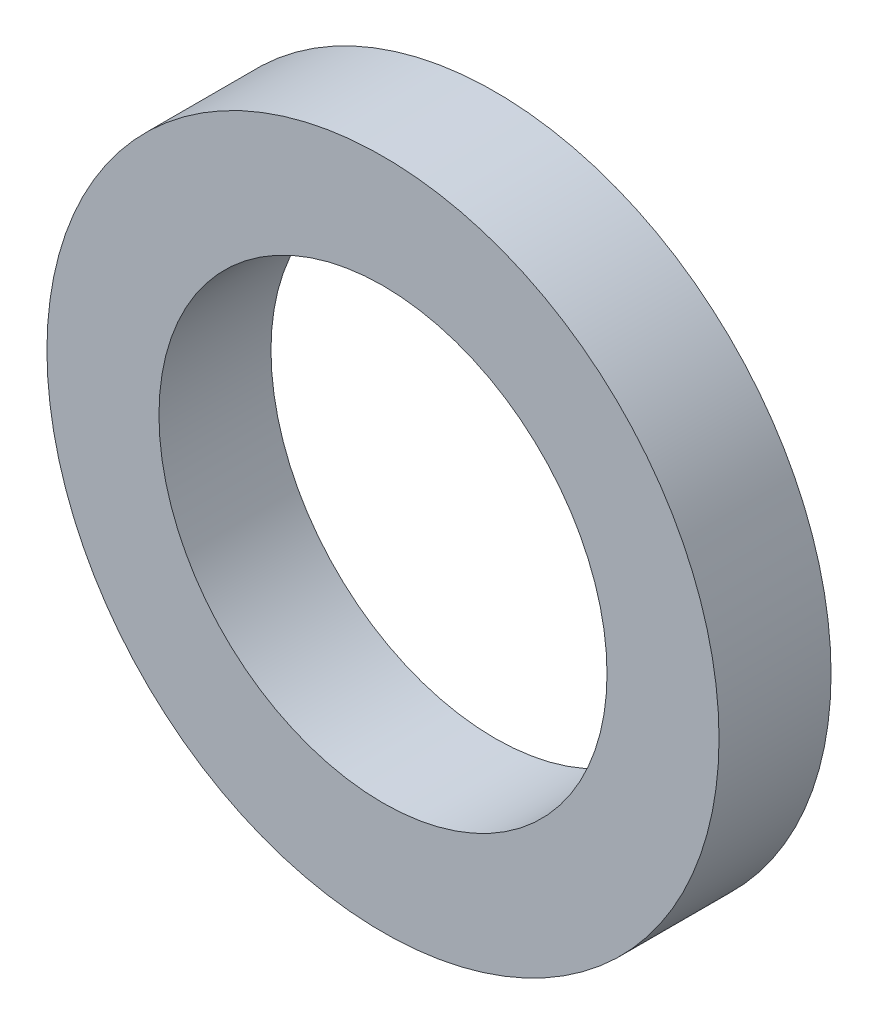
ISO-10303-21;
HEADER;
FILE_DESCRIPTION(('STEP AP214'),'2;1');
FILE_NAME('part.step','',(''),(''),'','','');
FILE_SCHEMA(('AUTOMOTIVE_DESIGN { 1 0 10303 214 1 1 1 1 }'));
ENDSEC;
DATA;
#1=APPLICATION_CONTEXT('core data for automotive mechanical design processes');
#2=APPLICATION_PROTOCOL_DEFINITION('international standard','automotive_design',2000,#1);
#3=PRODUCT_CONTEXT('',#1,'mechanical');
#4=PRODUCT('Part','Part','',(#3));
#5=PRODUCT_RELATED_PRODUCT_CATEGORY('part','',(#4));
#6=PRODUCT_DEFINITION_FORMATION('','',#4);
#7=PRODUCT_DEFINITION_CONTEXT('part definition',#1,'design');
#8=PRODUCT_DEFINITION('design','',#6,#7);
#9=PRODUCT_DEFINITION_SHAPE('','',#8);
#10=(LENGTH_UNIT() NAMED_UNIT(*) SI_UNIT(.MILLI.,.METRE.));
#11=(NAMED_UNIT(*) PLANE_ANGLE_UNIT() SI_UNIT($,.RADIAN.));
#12=(NAMED_UNIT(*) SI_UNIT($,.STERADIAN.) SOLID_ANGLE_UNIT());
#13=UNCERTAINTY_MEASURE_WITH_UNIT(LENGTH_MEASURE(1.E-05),#10,'distance_accuracy_value','');
#14=(GEOMETRIC_REPRESENTATION_CONTEXT(3) GLOBAL_UNCERTAINTY_ASSIGNED_CONTEXT((#13)) GLOBAL_UNIT_ASSIGNED_CONTEXT((#10,
#11,#12)) REPRESENTATION_CONTEXT('',''));
#15=CARTESIAN_POINT('',(0.,0.,0.));
#16=DIRECTION('',(0.,0.,1.));
#17=DIRECTION('',(1.,0.,0.));
#18=AXIS2_PLACEMENT_3D('',#15,#16,#17);
#19=CARTESIAN_POINT('',(0.,0.,5.));
#20=DIRECTION('',(0.,0.,1.));
#21=DIRECTION('',(1.,0.,0.));
#22=AXIS2_PLACEMENT_3D('',#19,#20,#21);
#23=PLANE('',#22);
#24=CARTESIAN_POINT('',(0.,0.,5.));
#25=DIRECTION('',(0.,0.,1.));
#26=DIRECTION('',(1.,0.,0.));
#27=AXIS2_PLACEMENT_3D('',#24,#25,#26);
#28=CIRCLE('',#27,15.);
#29=CARTESIAN_POINT('',(15.,0.,5.));
#30=VERTEX_POINT('',#29);
#31=EDGE_CURVE('E10',#30,#30,#28,.T.);
#32=ORIENTED_EDGE('',*,*,#31,.T.);
#33=EDGE_LOOP('',(#32));
#34=FACE_BOUND('',#33,.T.);
#35=CARTESIAN_POINT('',(0.,0.,5.));
#36=DIRECTION('',(0.,0.,1.));
#37=DIRECTION('',(1.,0.,0.));
#38=AXIS2_PLACEMENT_3D('',#35,#36,#37);
#39=CIRCLE('',#38,10.);
#40=CARTESIAN_POINT('',(10.,0.,5.));
#41=VERTEX_POINT('',#40);
#42=EDGE_CURVE('E50',#41,#41,#39,.T.);
#43=ORIENTED_EDGE('',*,*,#42,.F.);
#44=EDGE_LOOP('',(#43));
#45=FACE_BOUND('',#44,.T.);
#46=ADVANCED_FACE('F37',(#34,#45),#23,.T.);
#47=CARTESIAN_POINT('',(0.,0.,0.));
#48=DIRECTION('',(0.,0.,1.));
#49=DIRECTION('',(1.,0.,0.));
#50=AXIS2_PLACEMENT_3D('',#47,#48,#49);
#51=PLANE('',#50);
#52=CARTESIAN_POINT('',(0.,0.,0.));
#53=DIRECTION('',(0.,0.,1.));
#54=DIRECTION('',(1.,0.,0.));
#55=AXIS2_PLACEMENT_3D('',#52,#53,#54);
#56=CIRCLE('',#55,15.);
#57=CARTESIAN_POINT('',(15.,0.,0.));
#58=VERTEX_POINT('',#57);
#59=EDGE_CURVE('E41',#58,#58,#56,.T.);
#60=ORIENTED_EDGE('',*,*,#59,.F.);
#61=EDGE_LOOP('',(#60));
#62=FACE_BOUND('',#61,.T.);
#63=CARTESIAN_POINT('',(0.,0.,0.));
#64=DIRECTION('',(0.,0.,1.));
#65=DIRECTION('',(1.,0.,0.));
#66=AXIS2_PLACEMENT_3D('',#63,#64,#65);
#67=CIRCLE('',#66,10.);
#68=CARTESIAN_POINT('',(10.,0.,0.));
#69=VERTEX_POINT('',#68);
#70=EDGE_CURVE('E52',#69,#69,#67,.T.);
#71=ORIENTED_EDGE('',*,*,#70,.T.);
#72=EDGE_LOOP('',(#71));
#73=FACE_BOUND('',#72,.T.);
#74=ADVANCED_FACE('F64',(#62,#73),#51,.F.);
#75=CARTESIAN_POINT('',(0.,0.,5.));
#76=DIRECTION('',(0.,0.,-1.));
#77=DIRECTION('',(-1.,0.,0.));
#78=AXIS2_PLACEMENT_3D('',#75,#76,#77);
#79=CYLINDRICAL_SURFACE('',#78,15.);
#80=ORIENTED_EDGE('',*,*,#31,.F.);
#81=EDGE_LOOP('',(#80));
#82=FACE_BOUND('',#81,.T.);
#83=ORIENTED_EDGE('',*,*,#59,.T.);
#84=EDGE_LOOP('',(#83));
#85=FACE_BOUND('',#84,.T.);
#86=ADVANCED_FACE('F39',(#82,#85),#79,.T.);
#87=CARTESIAN_POINT('',(0.,0.,5.));
#88=DIRECTION('',(0.,0.,-1.));
#89=DIRECTION('',(-1.,0.,0.));
#90=AXIS2_PLACEMENT_3D('',#87,#88,#89);
#91=CYLINDRICAL_SURFACE('',#90,10.);
#92=ORIENTED_EDGE('',*,*,#42,.T.);
#93=EDGE_LOOP('',(#92));
#94=FACE_BOUND('',#93,.T.);
#95=ORIENTED_EDGE('',*,*,#70,.F.);
#96=EDGE_LOOP('',(#95));
#97=FACE_BOUND('',#96,.T.);
#98=ADVANCED_FACE('F60',(#94,#97),#91,.F.);
#99=CLOSED_SHELL('',(#46,#74,#86,#98));
#100=MANIFOLD_SOLID_BREP('B2',#99);
#101=ADVANCED_BREP_SHAPE_REPRESENTATION('',(#18,#100),#14);
#102=SHAPE_DEFINITION_REPRESENTATION(#9,#101);
ENDSEC;
END-ISO-10303-21;
